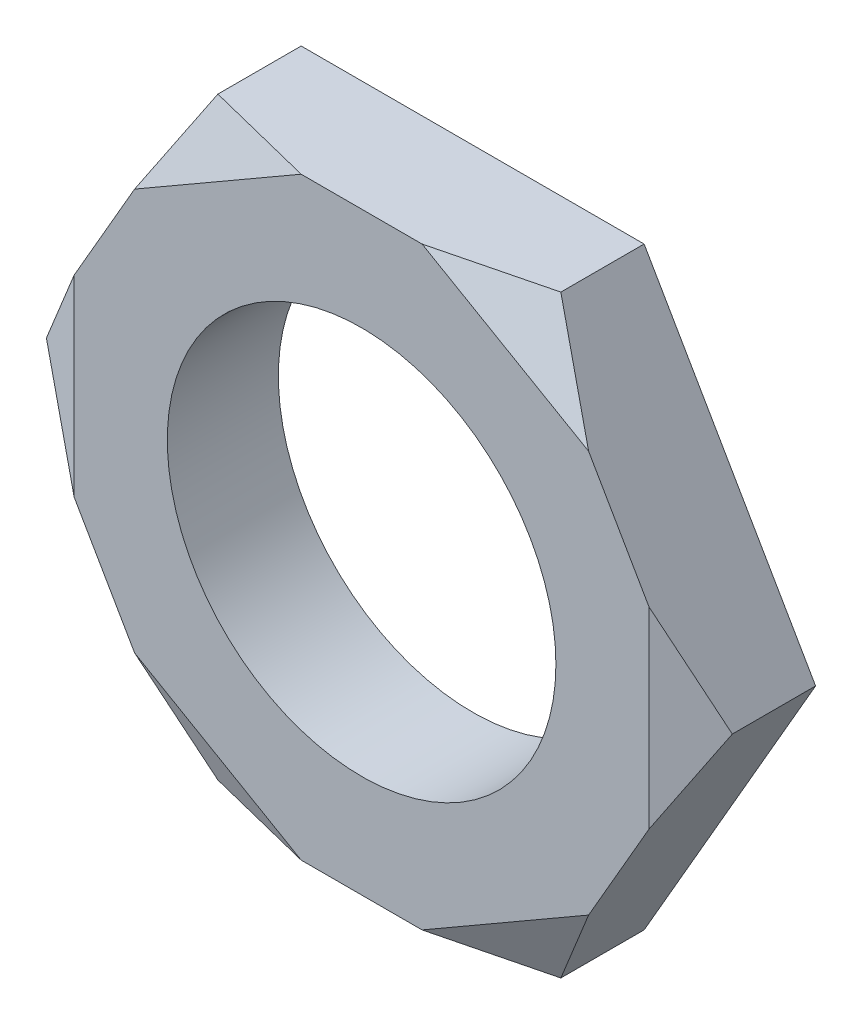
ISO-10303-21;
HEADER;
FILE_DESCRIPTION(('STEP AP214'),'2;1');
FILE_NAME('part.step','',(''),(''),'','','');
FILE_SCHEMA(('AUTOMOTIVE_DESIGN { 1 0 10303 214 1 1 1 1 }'));
ENDSEC;
DATA;
#1=APPLICATION_CONTEXT('core data for automotive mechanical design processes');
#2=APPLICATION_PROTOCOL_DEFINITION('international standard','automotive_design',2000,#1);
#3=PRODUCT_CONTEXT('',#1,'mechanical');
#4=PRODUCT('Part','Part','',(#3));
#5=PRODUCT_RELATED_PRODUCT_CATEGORY('part','',(#4));
#6=PRODUCT_DEFINITION_FORMATION('','',#4);
#7=PRODUCT_DEFINITION_CONTEXT('part definition',#1,'design');
#8=PRODUCT_DEFINITION('design','',#6,#7);
#9=PRODUCT_DEFINITION_SHAPE('','',#8);
#10=(LENGTH_UNIT() NAMED_UNIT(*) SI_UNIT(.MILLI.,.METRE.));
#11=(NAMED_UNIT(*) PLANE_ANGLE_UNIT() SI_UNIT($,.RADIAN.));
#12=(NAMED_UNIT(*) SI_UNIT($,.STERADIAN.) SOLID_ANGLE_UNIT());
#13=UNCERTAINTY_MEASURE_WITH_UNIT(LENGTH_MEASURE(1.E-05),#10,'distance_accuracy_value','');
#14=(GEOMETRIC_REPRESENTATION_CONTEXT(3) GLOBAL_UNCERTAINTY_ASSIGNED_CONTEXT((#13)) GLOBAL_UNIT_ASSIGNED_CONTEXT((#10,
#11,#12)) REPRESENTATION_CONTEXT('',''));
#15=CARTESIAN_POINT('',(0.,0.,0.));
#16=DIRECTION('',(0.,0.,1.));
#17=DIRECTION('',(1.,0.,0.));
#18=AXIS2_PLACEMENT_3D('',#15,#16,#17);
#19=CARTESIAN_POINT('',(0.,0.,2.));
#20=DIRECTION('',(0.,0.,1.));
#21=DIRECTION('',(1.,0.,0.));
#22=AXIS2_PLACEMENT_3D('',#19,#20,#21);
#23=PLANE('',#22);
#24=CARTESIAN_POINT('',(0.,0.,2.));
#25=DIRECTION('',(0.,0.,1.));
#26=DIRECTION('',(1.,0.,0.));
#27=AXIS2_PLACEMENT_3D('',#24,#25,#26);
#28=CIRCLE('',#27,3.5);
#29=CARTESIAN_POINT('',(3.5,0.,2.));
#30=VERTEX_POINT('',#29);
#31=EDGE_CURVE('E216',#30,#30,#28,.T.);
#32=ORIENTED_EDGE('',*,*,#31,.F.);
#33=EDGE_LOOP('',(#32));
#34=FACE_BOUND('',#33,.T.);
#35=DIRECTION('',(1.,0.,0.));
#36=VECTOR('',#35,1.);
#37=CARTESIAN_POINT('',(-3.08882394016449,-5.35000000000001,2.));
#38=LINE('',#37,#36);
#39=CARTESIAN_POINT('',(-1.08882394016449,-5.35,2.));
#40=VERTEX_POINT('',#39);
#41=CARTESIAN_POINT('',(1.08882394016455,-5.34999999999998,2.));
#42=VERTEX_POINT('',#41);
#43=EDGE_CURVE('E127',#40,#42,#38,.T.);
#44=ORIENTED_EDGE('',*,*,#43,.T.);
#45=DIRECTION('',(0.866025403784434,0.500000000000008,0.));
#46=VECTOR('',#45,1.);
#47=CARTESIAN_POINT('',(2.58882394016454,-4.48397459621553,2.));
#48=LINE('',#47,#46);
#49=CARTESIAN_POINT('',(4.08882394016454,-3.61794919243107,2.));
#50=VERTEX_POINT('',#49);
#51=EDGE_CURVE('E130',#42,#50,#48,.T.);
#52=ORIENTED_EDGE('',*,*,#51,.T.);
#53=DIRECTION('',(0.499999999999991,0.866025403784444,0.));
#54=VECTOR('',#53,1.);
#55=CARTESIAN_POINT('',(3.08882394016455,-5.34999999999996,2.));
#56=LINE('',#55,#54);
#57=CARTESIAN_POINT('',(5.17764788032901,-1.73205080756882,2.));
#58=VERTEX_POINT('',#57);
#59=EDGE_CURVE('E117',#50,#58,#56,.T.);
#60=ORIENTED_EDGE('',*,*,#59,.T.);
#61=DIRECTION('',(0.,1.,0.));
#62=VECTOR('',#61,1.);
#63=CARTESIAN_POINT('',(5.17764788032899,0.,2.));
#64=LINE('',#63,#62);
#65=CARTESIAN_POINT('',(5.17764788032897,1.73205080756894,2.));
#66=VERTEX_POINT('',#65);
#67=EDGE_CURVE('E165',#58,#66,#64,.T.);
#68=ORIENTED_EDGE('',*,*,#67,.T.);
#69=DIRECTION('',(-0.500000000000009,0.866025403784433,0.));
#70=VECTOR('',#69,1.);
#71=CARTESIAN_POINT('',(6.17764788032899,0.,2.));
#72=LINE('',#71,#70);
#73=CARTESIAN_POINT('',(4.08882394016446,3.61794919243117,2.));
#74=VERTEX_POINT('',#73);
#75=EDGE_CURVE('E126',#66,#74,#72,.T.);
#76=ORIENTED_EDGE('',*,*,#75,.T.);
#77=DIRECTION('',(-0.866025403784444,0.499999999999991,0.));
#78=VECTOR('',#77,1.);
#79=CARTESIAN_POINT('',(2.58882394016445,4.48397459621559,2.));
#80=LINE('',#79,#78);
#81=CARTESIAN_POINT('',(1.08882394016445,5.35000000000001,2.));
#82=VERTEX_POINT('',#81);
#83=EDGE_CURVE('E167',#74,#82,#80,.T.);
#84=ORIENTED_EDGE('',*,*,#83,.T.);
#85=DIRECTION('',(-1.,0.,0.));
#86=VECTOR('',#85,1.);
#87=CARTESIAN_POINT('',(3.08882394016444,5.35000000000003,2.));
#88=LINE('',#87,#86);
#89=CARTESIAN_POINT('',(-1.08882394016456,5.34999999999999,2.));
#90=VERTEX_POINT('',#89);
#91=EDGE_CURVE('E186',#82,#90,#88,.T.);
#92=ORIENTED_EDGE('',*,*,#91,.T.);
#93=DIRECTION('',(-0.866025403784435,-0.500000000000007,0.));
#94=VECTOR('',#93,1.);
#95=CARTESIAN_POINT('',(-2.58882394016454,4.48397459621554,2.));
#96=LINE('',#95,#94);
#97=CARTESIAN_POINT('',(-4.08882394016455,3.61794919243108,2.));
#98=VERTEX_POINT('',#97);
#99=EDGE_CURVE('E159',#90,#98,#96,.T.);
#100=ORIENTED_EDGE('',*,*,#99,.T.);
#101=DIRECTION('',(-0.499999999999995,-0.866025403784442,0.));
#102=VECTOR('',#101,1.);
#103=CARTESIAN_POINT('',(-3.08882394016456,5.34999999999997,2.));
#104=LINE('',#103,#102);
#105=CARTESIAN_POINT('',(-5.17764788032901,1.73205080756888,2.));
#106=VERTEX_POINT('',#105);
#107=EDGE_CURVE('E190',#98,#106,#104,.T.);
#108=ORIENTED_EDGE('',*,*,#107,.T.);
#109=DIRECTION('',(0.,-1.,0.));
#110=VECTOR('',#109,1.);
#111=CARTESIAN_POINT('',(-5.177647880329,0.,2.));
#112=LINE('',#111,#110);
#113=CARTESIAN_POINT('',(-5.177647880329,-1.73205080756888,2.));
#114=VERTEX_POINT('',#113);
#115=EDGE_CURVE('E150',#106,#114,#112,.T.);
#116=ORIENTED_EDGE('',*,*,#115,.T.);
#117=DIRECTION('',(0.500000000000001,-0.866025403784438,0.));
#118=VECTOR('',#117,1.);
#119=CARTESIAN_POINT('',(-6.177647880329,0.,2.));
#120=LINE('',#119,#118);
#121=CARTESIAN_POINT('',(-4.08882394016449,-3.61794919243114,2.));
#122=VERTEX_POINT('',#121);
#123=EDGE_CURVE('E211',#114,#122,#120,.T.);
#124=ORIENTED_EDGE('',*,*,#123,.T.);
#125=DIRECTION('',(0.866025403784441,-0.499999999999996,0.));
#126=VECTOR('',#125,1.);
#127=CARTESIAN_POINT('',(-2.58882394016448,-4.48397459621557,2.));
#128=LINE('',#127,#126);
#129=EDGE_CURVE('E142',#122,#40,#128,.T.);
#130=ORIENTED_EDGE('',*,*,#129,.T.);
#131=EDGE_LOOP('',(#44,#52,#60,#68,#76,#84,#92,#100,#108,#116,#124,#130));
#132=FACE_BOUND('',#131,.T.);
#133=ADVANCED_FACE('F33',(#34,#132),#23,.T.);
#134=CARTESIAN_POINT('',(-3.08882394016456,5.34999999999997,2.));
#135=DIRECTION('',(0.866025403784442,-0.499999999999995,0.));
#136=DIRECTION('',(0.499999999999995,0.866025403784442,0.));
#137=AXIS2_PLACEMENT_3D('',#134,#135,#136);
#138=PLANE('',#137);
#139=DIRECTION('',(-0.485071250072661,-0.840168050416809,-0.242535625036333));
#140=VECTOR('',#139,1.);
#141=CARTESIAN_POINT('',(-3.21169593664482,5.13717945926873,2.9829759718421));
#142=LINE('',#141,#140);
#143=CARTESIAN_POINT('',(-6.177647880329,0.,1.5));
#144=VERTEX_POINT('',#143);
#145=EDGE_CURVE('E147',#106,#144,#142,.T.);
#146=ORIENTED_EDGE('',*,*,#145,.F.);
#147=ORIENTED_EDGE('',*,*,#107,.F.);
#148=DIRECTION('',(-0.485071250072661,-0.840168050416809,0.242535625036333));
#149=VECTOR('',#148,1.);
#150=CARTESIAN_POINT('',(-3.14764746957633,5.24811465837827,1.52941176470588));
#151=LINE('',#150,#149);
#152=CARTESIAN_POINT('',(-3.08882394016456,5.34999999999997,1.5));
#153=VERTEX_POINT('',#152);
#154=EDGE_CURVE('E156',#153,#98,#151,.T.);
#155=ORIENTED_EDGE('',*,*,#154,.F.);
#156=DIRECTION('',(0.,0.,-1.));
#157=VECTOR('',#156,1.);
#158=CARTESIAN_POINT('',(-3.08882394016456,5.34999999999997,2.));
#159=LINE('',#158,#157);
#160=CARTESIAN_POINT('',(-3.08882394016456,5.34999999999997,0.));
#161=VERTEX_POINT('',#160);
#162=EDGE_CURVE('E184',#153,#161,#159,.T.);
#163=ORIENTED_EDGE('',*,*,#162,.T.);
#164=DIRECTION('',(-0.499999999999995,-0.866025403784442,0.));
#165=VECTOR('',#164,1.);
#166=CARTESIAN_POINT('',(-3.08882394016456,5.34999999999997,0.));
#167=LINE('',#166,#165);
#168=CARTESIAN_POINT('',(-6.177647880329,0.,0.));
#169=VERTEX_POINT('',#168);
#170=EDGE_CURVE('E203',#161,#169,#167,.T.);
#171=ORIENTED_EDGE('',*,*,#170,.T.);
#172=DIRECTION('',(0.,0.,-1.));
#173=VECTOR('',#172,1.);
#174=CARTESIAN_POINT('',(-6.177647880329,0.,2.));
#175=LINE('',#174,#173);
#176=EDGE_CURVE('E174',#144,#169,#175,.T.);
#177=ORIENTED_EDGE('',*,*,#176,.F.);
#178=EDGE_LOOP('',(#146,#147,#155,#163,#171,#177));
#179=FACE_BOUND('',#178,.T.);
#180=ADVANCED_FACE('F35',(#179),#138,.F.);
#181=CARTESIAN_POINT('',(-6.177647880329,0.,2.));
#182=DIRECTION('',(0.866025403784438,0.500000000000001,0.));
#183=DIRECTION('',(-0.500000000000001,0.866025403784438,0.));
#184=AXIS2_PLACEMENT_3D('',#181,#182,#183);
#185=PLANE('',#184);
#186=DIRECTION('',(0.485071250072667,-0.840168050416805,-0.242535625036333));
#187=VECTOR('',#186,1.);
#188=CARTESIAN_POINT('',(-6.05477588384873,-0.212820540731243,2.98297597184212));
#189=LINE('',#188,#187);
#190=CARTESIAN_POINT('',(-3.08882394016449,-5.35000000000001,1.5));
#191=VERTEX_POINT('',#190);
#192=EDGE_CURVE('E139',#122,#191,#189,.T.);
#193=ORIENTED_EDGE('',*,*,#192,.F.);
#194=ORIENTED_EDGE('',*,*,#123,.F.);
#195=DIRECTION('',(0.485071250072667,-0.840168050416805,0.242535625036333));
#196=VECTOR('',#195,1.);
#197=CARTESIAN_POINT('',(-6.11882435091723,-0.101885341621699,1.52941176470588));
#198=LINE('',#197,#196);
#199=EDGE_CURVE('E144',#144,#114,#198,.T.);
#200=ORIENTED_EDGE('',*,*,#199,.F.);
#201=ORIENTED_EDGE('',*,*,#176,.T.);
#202=DIRECTION('',(0.500000000000001,-0.866025403784438,0.));
#203=VECTOR('',#202,1.);
#204=CARTESIAN_POINT('',(-6.177647880329,0.,0.));
#205=LINE('',#204,#203);
#206=CARTESIAN_POINT('',(-3.08882394016449,-5.35000000000001,0.));
#207=VERTEX_POINT('',#206);
#208=EDGE_CURVE('E200',#169,#207,#205,.T.);
#209=ORIENTED_EDGE('',*,*,#208,.T.);
#210=DIRECTION('',(0.,0.,-1.));
#211=VECTOR('',#210,1.);
#212=CARTESIAN_POINT('',(-3.08882394016449,-5.35000000000001,2.));
#213=LINE('',#212,#211);
#214=EDGE_CURVE('E176',#191,#207,#213,.T.);
#215=ORIENTED_EDGE('',*,*,#214,.F.);
#216=EDGE_LOOP('',(#193,#194,#200,#201,#209,#215));
#217=FACE_BOUND('',#216,.T.);
#218=ADVANCED_FACE('F237',(#217),#185,.F.);
#219=CARTESIAN_POINT('',(-3.08882394016449,-5.35000000000001,2.));
#220=DIRECTION('',(0.,1.,0.));
#221=DIRECTION('',(-1.,0.,0.));
#222=AXIS2_PLACEMENT_3D('',#219,#220,#221);
#223=PLANE('',#222);
#224=DIRECTION('',(0.970142500145332,0.,-0.242535625036333));
#225=VECTOR('',#224,1.);
#226=CARTESIAN_POINT('',(-2.84307994720396,-5.35000000000001,2.98297597184213));
#227=LINE('',#226,#225);
#228=CARTESIAN_POINT('',(3.08882394016455,-5.34999999999996,1.5));
#229=VERTEX_POINT('',#228);
#230=EDGE_CURVE('E41',#42,#229,#227,.T.);
#231=ORIENTED_EDGE('',*,*,#230,.F.);
#232=ORIENTED_EDGE('',*,*,#43,.F.);
#233=DIRECTION('',(0.970142500145332,0.,0.242535625036333));
#234=VECTOR('',#233,1.);
#235=CARTESIAN_POINT('',(-2.97117688134096,-5.35000000000001,1.52941176470588));
#236=LINE('',#235,#234);
#237=EDGE_CURVE('E133',#191,#40,#236,.T.);
#238=ORIENTED_EDGE('',*,*,#237,.F.);
#239=ORIENTED_EDGE('',*,*,#214,.T.);
#240=DIRECTION('',(1.,0.,0.));
#241=VECTOR('',#240,1.);
#242=CARTESIAN_POINT('',(-3.08882394016449,-5.35000000000001,0.));
#243=LINE('',#242,#241);
#244=CARTESIAN_POINT('',(3.08882394016455,-5.34999999999996,0.));
#245=VERTEX_POINT('',#244);
#246=EDGE_CURVE('E197',#207,#245,#243,.T.);
#247=ORIENTED_EDGE('',*,*,#246,.T.);
#248=DIRECTION('',(0.,0.,-1.));
#249=VECTOR('',#248,1.);
#250=CARTESIAN_POINT('',(3.08882394016455,-5.34999999999996,2.));
#251=LINE('',#250,#249);
#252=EDGE_CURVE('E178',#229,#245,#251,.T.);
#253=ORIENTED_EDGE('',*,*,#252,.F.);
#254=EDGE_LOOP('',(#231,#232,#238,#239,#247,#253));
#255=FACE_BOUND('',#254,.T.);
#256=ADVANCED_FACE('F253',(#255),#223,.F.);
#257=CARTESIAN_POINT('',(3.08882394016455,-5.34999999999996,2.));
#258=DIRECTION('',(-0.866025403784444,0.499999999999991,0.));
#259=DIRECTION('',(-0.499999999999991,-0.866025403784444,0.));
#260=AXIS2_PLACEMENT_3D('',#257,#258,#259);
#261=PLANE('',#260);
#262=DIRECTION('',(0.485071250072657,0.840168050416811,0.242535625036333));
#263=VECTOR('',#262,1.);
#264=CARTESIAN_POINT('',(3.14764746957632,-5.24811465837826,1.52941176470588));
#265=LINE('',#264,#263);
#266=EDGE_CURVE('E11',#229,#50,#265,.T.);
#267=ORIENTED_EDGE('',*,*,#266,.F.);
#268=ORIENTED_EDGE('',*,*,#252,.T.);
#269=DIRECTION('',(0.499999999999991,0.866025403784444,0.));
#270=VECTOR('',#269,1.);
#271=CARTESIAN_POINT('',(3.08882394016455,-5.34999999999996,0.));
#272=LINE('',#271,#270);
#273=CARTESIAN_POINT('',(6.17764788032899,0.,0.));
#274=VERTEX_POINT('',#273);
#275=EDGE_CURVE('E194',#245,#274,#272,.T.);
#276=ORIENTED_EDGE('',*,*,#275,.T.);
#277=DIRECTION('',(0.,0.,-1.));
#278=VECTOR('',#277,1.);
#279=CARTESIAN_POINT('',(6.17764788032899,0.,2.));
#280=LINE('',#279,#278);
#281=CARTESIAN_POINT('',(6.17764788032899,0.,1.5));
#282=VERTEX_POINT('',#281);
#283=EDGE_CURVE('E180',#282,#274,#280,.T.);
#284=ORIENTED_EDGE('',*,*,#283,.F.);
#285=DIRECTION('',(0.485071250072657,0.840168050416811,-0.242535625036333));
#286=VECTOR('',#285,1.);
#287=CARTESIAN_POINT('',(3.21169593664482,-5.13717945926872,2.98297597184212));
#288=LINE('',#287,#286);
#289=EDGE_CURVE('E122',#58,#282,#288,.T.);
#290=ORIENTED_EDGE('',*,*,#289,.F.);
#291=ORIENTED_EDGE('',*,*,#59,.F.);
#292=EDGE_LOOP('',(#267,#268,#276,#284,#290,#291));
#293=FACE_BOUND('',#292,.T.);
#294=ADVANCED_FACE('F119',(#293),#261,.F.);
#295=CARTESIAN_POINT('',(6.17764788032899,0.,2.));
#296=DIRECTION('',(-0.866025403784433,-0.500000000000009,0.));
#297=DIRECTION('',(0.500000000000009,-0.866025403784433,0.));
#298=AXIS2_PLACEMENT_3D('',#295,#296,#297);
#299=PLANE('',#298);
#300=DIRECTION('',(-0.485071250072675,0.840168050416801,0.242535625036333));
#301=VECTOR('',#300,1.);
#302=CARTESIAN_POINT('',(6.11882435091723,0.101885341621768,1.52941176470588));
#303=LINE('',#302,#301);
#304=EDGE_CURVE('E161',#282,#66,#303,.T.);
#305=ORIENTED_EDGE('',*,*,#304,.F.);
#306=ORIENTED_EDGE('',*,*,#283,.T.);
#307=DIRECTION('',(-0.500000000000009,0.866025403784433,0.));
#308=VECTOR('',#307,1.);
#309=CARTESIAN_POINT('',(6.17764788032899,0.,0.));
#310=LINE('',#309,#308);
#311=CARTESIAN_POINT('',(3.08882394016444,5.35000000000003,0.));
#312=VERTEX_POINT('',#311);
#313=EDGE_CURVE('E191',#274,#312,#310,.T.);
#314=ORIENTED_EDGE('',*,*,#313,.T.);
#315=DIRECTION('',(0.,0.,-1.));
#316=VECTOR('',#315,1.);
#317=CARTESIAN_POINT('',(3.08882394016444,5.35000000000003,2.));
#318=LINE('',#317,#316);
#319=CARTESIAN_POINT('',(3.08882394016444,5.35000000000003,1.5));
#320=VERTEX_POINT('',#319);
#321=EDGE_CURVE('E182',#320,#312,#318,.T.);
#322=ORIENTED_EDGE('',*,*,#321,.F.);
#323=DIRECTION('',(-0.485071250072675,0.840168050416801,-0.242535625036333));
#324=VECTOR('',#323,1.);
#325=CARTESIAN_POINT('',(6.05477588384873,0.212820540731311,2.98297597184212));
#326=LINE('',#325,#324);
#327=EDGE_CURVE('E172',#74,#320,#326,.T.);
#328=ORIENTED_EDGE('',*,*,#327,.F.);
#329=ORIENTED_EDGE('',*,*,#75,.F.);
#330=EDGE_LOOP('',(#305,#306,#314,#322,#328,#329));
#331=FACE_BOUND('',#330,.T.);
#332=ADVANCED_FACE('F246',(#331),#299,.F.);
#333=CARTESIAN_POINT('',(3.08882394016444,5.35000000000003,2.));
#334=DIRECTION('',(0.,-1.,0.));
#335=DIRECTION('',(1.,0.,0.));
#336=AXIS2_PLACEMENT_3D('',#333,#334,#335);
#337=PLANE('',#336);
#338=DIRECTION('',(-0.970142500145332,0.,-0.242535625036333));
#339=VECTOR('',#338,1.);
#340=CARTESIAN_POINT('',(2.84307994720391,5.35000000000003,2.98297597184212));
#341=LINE('',#340,#339);
#342=EDGE_CURVE('E153',#90,#153,#341,.T.);
#343=ORIENTED_EDGE('',*,*,#342,.F.);
#344=ORIENTED_EDGE('',*,*,#91,.F.);
#345=DIRECTION('',(-0.970142500145332,0.,0.242535625036333));
#346=VECTOR('',#345,1.);
#347=CARTESIAN_POINT('',(2.97117688134091,5.35000000000003,1.52941176470588));
#348=LINE('',#347,#346);
#349=EDGE_CURVE('E170',#320,#82,#348,.T.);
#350=ORIENTED_EDGE('',*,*,#349,.F.);
#351=ORIENTED_EDGE('',*,*,#321,.T.);
#352=DIRECTION('',(-1.,0.,0.));
#353=VECTOR('',#352,1.);
#354=CARTESIAN_POINT('',(3.08882394016444,5.35000000000003,0.));
#355=LINE('',#354,#353);
#356=EDGE_CURVE('E187',#312,#161,#355,.T.);
#357=ORIENTED_EDGE('',*,*,#356,.T.);
#358=ORIENTED_EDGE('',*,*,#162,.F.);
#359=EDGE_LOOP('',(#343,#344,#350,#351,#357,#358));
#360=FACE_BOUND('',#359,.T.);
#361=ADVANCED_FACE('F243',(#360),#337,.F.);
#362=CARTESIAN_POINT('',(0.,0.,0.));
#363=DIRECTION('',(0.,0.,1.));
#364=DIRECTION('',(1.,0.,0.));
#365=AXIS2_PLACEMENT_3D('',#362,#363,#364);
#366=PLANE('',#365);
#367=CARTESIAN_POINT('',(0.,0.,0.));
#368=DIRECTION('',(0.,0.,1.));
#369=DIRECTION('',(1.,0.,0.));
#370=AXIS2_PLACEMENT_3D('',#367,#368,#369);
#371=CIRCLE('',#370,3.5);
#372=CARTESIAN_POINT('',(3.5,0.,0.));
#373=VERTEX_POINT('',#372);
#374=EDGE_CURVE('E206',#373,#373,#371,.T.);
#375=ORIENTED_EDGE('',*,*,#374,.T.);
#376=EDGE_LOOP('',(#375));
#377=FACE_BOUND('',#376,.T.);
#378=ORIENTED_EDGE('',*,*,#170,.F.);
#379=ORIENTED_EDGE('',*,*,#356,.F.);
#380=ORIENTED_EDGE('',*,*,#313,.F.);
#381=ORIENTED_EDGE('',*,*,#275,.F.);
#382=ORIENTED_EDGE('',*,*,#246,.F.);
#383=ORIENTED_EDGE('',*,*,#208,.F.);
#384=EDGE_LOOP('',(#378,#379,#380,#381,#382,#383));
#385=FACE_BOUND('',#384,.T.);
#386=ADVANCED_FACE('F222',(#377,#385),#366,.F.);
#387=CARTESIAN_POINT('',(0.,0.,0.));
#388=DIRECTION('',(0.,0.,1.));
#389=DIRECTION('',(1.,0.,0.));
#390=AXIS2_PLACEMENT_3D('',#387,#388,#389);
#391=CYLINDRICAL_SURFACE('',#390,3.5);
#392=ORIENTED_EDGE('',*,*,#374,.F.);
#393=EDGE_LOOP('',(#392));
#394=FACE_BOUND('',#393,.T.);
#395=ORIENTED_EDGE('',*,*,#31,.T.);
#396=EDGE_LOOP('',(#395));
#397=FACE_BOUND('',#396,.T.);
#398=ADVANCED_FACE('F225',(#394,#397),#391,.F.);
#399=CARTESIAN_POINT('',(0.917764788032883,1.58961524227067,3.6710591521316));
#400=DIRECTION('',(0.223606797749975,0.387298334620744,0.894427190999916));
#401=DIRECTION('',(0.,-0.917662935482246,0.397359707119515));
#402=AXIS2_PLACEMENT_3D('',#399,#400,#401);
#403=PLANE('',#402);
#404=ORIENTED_EDGE('',*,*,#83,.F.);
#405=ORIENTED_EDGE('',*,*,#327,.T.);
#406=ORIENTED_EDGE('',*,*,#349,.T.);
#407=EDGE_LOOP('',(#404,#405,#406));
#408=FACE_BOUND('',#407,.T.);
#409=ADVANCED_FACE('F228',(#408),#403,.T.);
#410=CARTESIAN_POINT('',(1.8355295760658,0.,3.6710591521316));
#411=DIRECTION('',(0.447213595499958,0.,0.894427190999916));
#412=DIRECTION('',(0.894427190999916,0.,-0.447213595499958));
#413=AXIS2_PLACEMENT_3D('',#410,#411,#412);
#414=PLANE('',#413);
#415=ORIENTED_EDGE('',*,*,#67,.F.);
#416=ORIENTED_EDGE('',*,*,#289,.T.);
#417=ORIENTED_EDGE('',*,*,#304,.T.);
#418=EDGE_LOOP('',(#415,#416,#417));
#419=FACE_BOUND('',#418,.T.);
#420=ADVANCED_FACE('F272',(#419),#414,.T.);
#421=CARTESIAN_POINT('',(-0.917764788032917,1.58961524227066,3.6710591521316));
#422=DIRECTION('',(-0.223606797749983,0.387298334620741,0.894427190999915));
#423=DIRECTION('',(0.,-0.917662935482247,0.397359707119513));
#424=AXIS2_PLACEMENT_3D('',#421,#422,#423);
#425=PLANE('',#424);
#426=ORIENTED_EDGE('',*,*,#99,.F.);
#427=ORIENTED_EDGE('',*,*,#342,.T.);
#428=ORIENTED_EDGE('',*,*,#154,.T.);
#429=EDGE_LOOP('',(#426,#427,#428));
#430=FACE_BOUND('',#429,.T.);
#431=ADVANCED_FACE('F282',(#430),#425,.T.);
#432=CARTESIAN_POINT('',(-1.83552957606581,0.,3.6710591521316));
#433=DIRECTION('',(-0.447213595499959,0.,0.894427190999915));
#434=DIRECTION('',(0.894427190999915,0.,0.447213595499959));
#435=AXIS2_PLACEMENT_3D('',#432,#433,#434);
#436=PLANE('',#435);
#437=ORIENTED_EDGE('',*,*,#115,.F.);
#438=ORIENTED_EDGE('',*,*,#145,.T.);
#439=ORIENTED_EDGE('',*,*,#199,.T.);
#440=EDGE_LOOP('',(#437,#438,#439));
#441=FACE_BOUND('',#440,.T.);
#442=ADVANCED_FACE('F285',(#441),#436,.T.);
#443=CARTESIAN_POINT('',(-0.917764788032887,-1.58961524227066,3.67105915213159));
#444=DIRECTION('',(-0.223606797749976,-0.387298334620741,0.894427190999917));
#445=DIRECTION('',(0.,-0.917662935482248,-0.397359707119512));
#446=AXIS2_PLACEMENT_3D('',#443,#444,#445);
#447=PLANE('',#446);
#448=ORIENTED_EDGE('',*,*,#129,.F.);
#449=ORIENTED_EDGE('',*,*,#192,.T.);
#450=ORIENTED_EDGE('',*,*,#237,.T.);
#451=EDGE_LOOP('',(#448,#449,#450));
#452=FACE_BOUND('',#451,.T.);
#453=ADVANCED_FACE('F263',(#452),#447,.T.);
#454=CARTESIAN_POINT('',(0.91776478803291,-1.58961524227065,3.67105915213159));
#455=DIRECTION('',(0.223606797749982,-0.387298334620739,0.894427190999917));
#456=DIRECTION('',(0.,-0.917662935482248,-0.39735970711951));
#457=AXIS2_PLACEMENT_3D('',#454,#455,#456);
#458=PLANE('',#457);
#459=ORIENTED_EDGE('',*,*,#51,.F.);
#460=ORIENTED_EDGE('',*,*,#230,.T.);
#461=ORIENTED_EDGE('',*,*,#266,.T.);
#462=EDGE_LOOP('',(#459,#460,#461));
#463=FACE_BOUND('',#462,.T.);
#464=ADVANCED_FACE('F135',(#463),#458,.T.);
#465=CLOSED_SHELL('',(#133,#180,#218,#256,#294,#332,#361,#386,#398,#409,#420,#431,#442,#453,#464));
#466=MANIFOLD_SOLID_BREP('B2',#465);
#467=ADVANCED_BREP_SHAPE_REPRESENTATION('',(#18,#466),#14);
#468=SHAPE_DEFINITION_REPRESENTATION(#9,#467);
ENDSEC;
END-ISO-10303-21;
